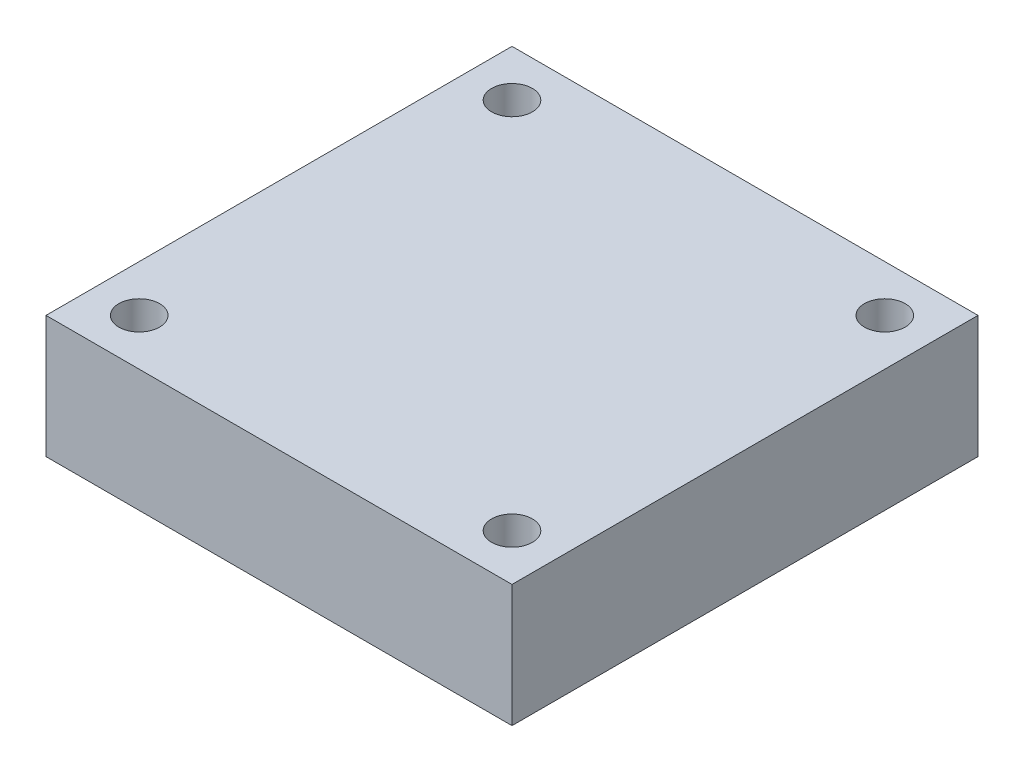
ISO-10303-21;
HEADER;
FILE_DESCRIPTION(('STEP AP214'),'2;1');
FILE_NAME('part.step','',(''),(''),'','','');
FILE_SCHEMA(('AUTOMOTIVE_DESIGN { 1 0 10303 214 1 1 1 1 }'));
ENDSEC;
DATA;
#1=APPLICATION_CONTEXT('core data for automotive mechanical design processes');
#2=APPLICATION_PROTOCOL_DEFINITION('international standard','automotive_design',2000,#1);
#3=PRODUCT_CONTEXT('',#1,'mechanical');
#4=PRODUCT('Part','Part','',(#3));
#5=PRODUCT_RELATED_PRODUCT_CATEGORY('part','',(#4));
#6=PRODUCT_DEFINITION_FORMATION('','',#4);
#7=PRODUCT_DEFINITION_CONTEXT('part definition',#1,'design');
#8=PRODUCT_DEFINITION('design','',#6,#7);
#9=PRODUCT_DEFINITION_SHAPE('','',#8);
#10=(LENGTH_UNIT() NAMED_UNIT(*) SI_UNIT(.MILLI.,.METRE.));
#11=(NAMED_UNIT(*) PLANE_ANGLE_UNIT() SI_UNIT($,.RADIAN.));
#12=(NAMED_UNIT(*) SI_UNIT($,.STERADIAN.) SOLID_ANGLE_UNIT());
#13=UNCERTAINTY_MEASURE_WITH_UNIT(LENGTH_MEASURE(1.E-05),#10,'distance_accuracy_value','');
#14=(GEOMETRIC_REPRESENTATION_CONTEXT(3) GLOBAL_UNCERTAINTY_ASSIGNED_CONTEXT((#13)) GLOBAL_UNIT_ASSIGNED_CONTEXT((#10,
#11,#12)) REPRESENTATION_CONTEXT('',''));
#15=CARTESIAN_POINT('',(0.,0.,0.));
#16=DIRECTION('',(0.,0.,1.));
#17=DIRECTION('',(1.,0.,0.));
#18=AXIS2_PLACEMENT_3D('',#15,#16,#17);
#19=CARTESIAN_POINT('',(-20.,10.5,20.));
#20=DIRECTION('',(1.,0.,0.));
#21=DIRECTION('',(0.,0.,-1.));
#22=AXIS2_PLACEMENT_3D('',#19,#20,#21);
#23=PLANE('',#22);
#24=DIRECTION('',(0.,0.,1.));
#25=VECTOR('',#24,1.);
#26=CARTESIAN_POINT('',(-20.,0.,20.));
#27=LINE('',#26,#25);
#28=CARTESIAN_POINT('',(-20.,0.,-20.));
#29=VERTEX_POINT('',#28);
#30=CARTESIAN_POINT('',(-20.,0.,20.));
#31=VERTEX_POINT('',#30);
#32=EDGE_CURVE('E96',#29,#31,#27,.T.);
#33=ORIENTED_EDGE('',*,*,#32,.T.);
#34=DIRECTION('',(0.,-1.,0.));
#35=VECTOR('',#34,1.);
#36=CARTESIAN_POINT('',(-20.,10.5,20.));
#37=LINE('',#36,#35);
#38=CARTESIAN_POINT('',(-20.,10.5,20.));
#39=VERTEX_POINT('',#38);
#40=EDGE_CURVE('E11',#39,#31,#37,.T.);
#41=ORIENTED_EDGE('',*,*,#40,.F.);
#42=DIRECTION('',(0.,0.,1.));
#43=VECTOR('',#42,1.);
#44=CARTESIAN_POINT('',(-20.,10.5,20.));
#45=LINE('',#44,#43);
#46=CARTESIAN_POINT('',(-20.,10.5,-20.));
#47=VERTEX_POINT('',#46);
#48=EDGE_CURVE('E84',#47,#39,#45,.T.);
#49=ORIENTED_EDGE('',*,*,#48,.F.);
#50=DIRECTION('',(0.,-1.,0.));
#51=VECTOR('',#50,1.);
#52=CARTESIAN_POINT('',(-20.,10.5,-20.));
#53=LINE('',#52,#51);
#54=EDGE_CURVE('E92',#47,#29,#53,.T.);
#55=ORIENTED_EDGE('',*,*,#54,.T.);
#56=EDGE_LOOP('',(#33,#41,#49,#55));
#57=FACE_BOUND('',#56,.T.);
#58=ADVANCED_FACE('F33',(#57),#23,.F.);
#59=CARTESIAN_POINT('',(20.,10.5,20.));
#60=DIRECTION('',(0.,0.,-1.));
#61=DIRECTION('',(-1.,0.,0.));
#62=AXIS2_PLACEMENT_3D('',#59,#60,#61);
#63=PLANE('',#62);
#64=DIRECTION('',(1.,0.,0.));
#65=VECTOR('',#64,1.);
#66=CARTESIAN_POINT('',(20.,0.,20.));
#67=LINE('',#66,#65);
#68=CARTESIAN_POINT('',(20.,0.,20.));
#69=VERTEX_POINT('',#68);
#70=EDGE_CURVE('E88',#31,#69,#67,.T.);
#71=ORIENTED_EDGE('',*,*,#70,.T.);
#72=DIRECTION('',(0.,-1.,0.));
#73=VECTOR('',#72,1.);
#74=CARTESIAN_POINT('',(20.,10.5,20.));
#75=LINE('',#74,#73);
#76=CARTESIAN_POINT('',(20.,10.5,20.));
#77=VERTEX_POINT('',#76);
#78=EDGE_CURVE('E41',#77,#69,#75,.T.);
#79=ORIENTED_EDGE('',*,*,#78,.F.);
#80=DIRECTION('',(1.,0.,0.));
#81=VECTOR('',#80,1.);
#82=CARTESIAN_POINT('',(20.,10.5,20.));
#83=LINE('',#82,#81);
#84=EDGE_CURVE('E79',#39,#77,#83,.T.);
#85=ORIENTED_EDGE('',*,*,#84,.F.);
#86=ORIENTED_EDGE('',*,*,#40,.T.);
#87=EDGE_LOOP('',(#71,#79,#85,#86));
#88=FACE_BOUND('',#87,.T.);
#89=ADVANCED_FACE('F87',(#88),#63,.F.);
#90=CARTESIAN_POINT('',(20.,10.5,20.));
#91=DIRECTION('',(-1.,0.,0.));
#92=DIRECTION('',(0.,0.,1.));
#93=AXIS2_PLACEMENT_3D('',#90,#91,#92);
#94=PLANE('',#93);
#95=DIRECTION('',(0.,0.,-1.));
#96=VECTOR('',#95,1.);
#97=CARTESIAN_POINT('',(20.,0.,20.));
#98=LINE('',#97,#96);
#99=CARTESIAN_POINT('',(20.,0.,-20.));
#100=VERTEX_POINT('',#99);
#101=EDGE_CURVE('E66',#69,#100,#98,.T.);
#102=ORIENTED_EDGE('',*,*,#101,.T.);
#103=DIRECTION('',(0.,-1.,0.));
#104=VECTOR('',#103,1.);
#105=CARTESIAN_POINT('',(20.,10.5,-20.));
#106=LINE('',#105,#104);
#107=CARTESIAN_POINT('',(20.,10.5,-20.));
#108=VERTEX_POINT('',#107);
#109=EDGE_CURVE('E89',#108,#100,#106,.T.);
#110=ORIENTED_EDGE('',*,*,#109,.F.);
#111=DIRECTION('',(0.,0.,-1.));
#112=VECTOR('',#111,1.);
#113=CARTESIAN_POINT('',(20.,10.5,20.));
#114=LINE('',#113,#112);
#115=EDGE_CURVE('E82',#77,#108,#114,.T.);
#116=ORIENTED_EDGE('',*,*,#115,.F.);
#117=ORIENTED_EDGE('',*,*,#78,.T.);
#118=EDGE_LOOP('',(#102,#110,#116,#117));
#119=FACE_BOUND('',#118,.T.);
#120=ADVANCED_FACE('F90',(#119),#94,.F.);
#121=CARTESIAN_POINT('',(20.,10.5,-20.));
#122=DIRECTION('',(0.,0.,1.));
#123=DIRECTION('',(1.,0.,0.));
#124=AXIS2_PLACEMENT_3D('',#121,#122,#123);
#125=PLANE('',#124);
#126=DIRECTION('',(-1.,0.,0.));
#127=VECTOR('',#126,1.);
#128=CARTESIAN_POINT('',(20.,0.,-20.));
#129=LINE('',#128,#127);
#130=EDGE_CURVE('E72',#100,#29,#129,.T.);
#131=ORIENTED_EDGE('',*,*,#130,.T.);
#132=ORIENTED_EDGE('',*,*,#54,.F.);
#133=DIRECTION('',(-1.,0.,0.));
#134=VECTOR('',#133,1.);
#135=CARTESIAN_POINT('',(20.,10.5,-20.));
#136=LINE('',#135,#134);
#137=EDGE_CURVE('E49',#108,#47,#136,.T.);
#138=ORIENTED_EDGE('',*,*,#137,.F.);
#139=ORIENTED_EDGE('',*,*,#109,.T.);
#140=EDGE_LOOP('',(#131,#132,#138,#139));
#141=FACE_BOUND('',#140,.T.);
#142=ADVANCED_FACE('F104',(#141),#125,.F.);
#143=CARTESIAN_POINT('',(0.,10.5,0.));
#144=DIRECTION('',(0.,1.,0.));
#145=DIRECTION('',(0.,0.,1.));
#146=AXIS2_PLACEMENT_3D('',#143,#144,#145);
#147=PLANE('',#146);
#148=CARTESIAN_POINT('',(-16.,10.5,16.));
#149=DIRECTION('',(0.,1.,0.));
#150=DIRECTION('',(0.,0.,1.));
#151=AXIS2_PLACEMENT_3D('',#148,#149,#150);
#152=CIRCLE('',#151,1.75);
#153=CARTESIAN_POINT('',(-16.,10.5,17.75));
#154=VERTEX_POINT('',#153);
#155=EDGE_CURVE('E128',#154,#154,#152,.T.);
#156=ORIENTED_EDGE('',*,*,#155,.F.);
#157=EDGE_LOOP('',(#156));
#158=FACE_BOUND('',#157,.T.);
#159=CARTESIAN_POINT('',(16.,10.5,16.));
#160=DIRECTION('',(0.,1.,0.));
#161=DIRECTION('',(0.,0.,1.));
#162=AXIS2_PLACEMENT_3D('',#159,#160,#161);
#163=CIRCLE('',#162,1.75);
#164=CARTESIAN_POINT('',(16.,10.5,17.75));
#165=VERTEX_POINT('',#164);
#166=EDGE_CURVE('E122',#165,#165,#163,.T.);
#167=ORIENTED_EDGE('',*,*,#166,.F.);
#168=EDGE_LOOP('',(#167));
#169=FACE_BOUND('',#168,.T.);
#170=CARTESIAN_POINT('',(16.,10.5,-16.));
#171=DIRECTION('',(0.,1.,0.));
#172=DIRECTION('',(0.,0.,1.));
#173=AXIS2_PLACEMENT_3D('',#170,#171,#172);
#174=CIRCLE('',#173,1.75);
#175=CARTESIAN_POINT('',(16.,10.5,-14.25));
#176=VERTEX_POINT('',#175);
#177=EDGE_CURVE('E116',#176,#176,#174,.T.);
#178=ORIENTED_EDGE('',*,*,#177,.F.);
#179=EDGE_LOOP('',(#178));
#180=FACE_BOUND('',#179,.T.);
#181=CARTESIAN_POINT('',(-16.,10.5,-16.));
#182=DIRECTION('',(0.,1.,0.));
#183=DIRECTION('',(0.,0.,1.));
#184=AXIS2_PLACEMENT_3D('',#181,#182,#183);
#185=CIRCLE('',#184,1.75);
#186=CARTESIAN_POINT('',(-16.,10.5,-14.25));
#187=VERTEX_POINT('',#186);
#188=EDGE_CURVE('E110',#187,#187,#185,.T.);
#189=ORIENTED_EDGE('',*,*,#188,.F.);
#190=EDGE_LOOP('',(#189));
#191=FACE_BOUND('',#190,.T.);
#192=ORIENTED_EDGE('',*,*,#48,.T.);
#193=ORIENTED_EDGE('',*,*,#84,.T.);
#194=ORIENTED_EDGE('',*,*,#115,.T.);
#195=ORIENTED_EDGE('',*,*,#137,.T.);
#196=EDGE_LOOP('',(#192,#193,#194,#195));
#197=FACE_BOUND('',#196,.T.);
#198=ADVANCED_FACE('F80',(#158,#169,#180,#191,#197),#147,.T.);
#199=CARTESIAN_POINT('',(0.,0.,0.));
#200=DIRECTION('',(0.,1.,0.));
#201=DIRECTION('',(0.,0.,1.));
#202=AXIS2_PLACEMENT_3D('',#199,#200,#201);
#203=PLANE('',#202);
#204=CARTESIAN_POINT('',(-16.,0.,16.));
#205=DIRECTION('',(0.,1.,0.));
#206=DIRECTION('',(0.,0.,1.));
#207=AXIS2_PLACEMENT_3D('',#204,#205,#206);
#208=CIRCLE('',#207,1.75);
#209=CARTESIAN_POINT('',(-16.,0.,17.75));
#210=VERTEX_POINT('',#209);
#211=EDGE_CURVE('E125',#210,#210,#208,.T.);
#212=ORIENTED_EDGE('',*,*,#211,.T.);
#213=EDGE_LOOP('',(#212));
#214=FACE_BOUND('',#213,.T.);
#215=CARTESIAN_POINT('',(16.,0.,16.));
#216=DIRECTION('',(0.,1.,0.));
#217=DIRECTION('',(0.,0.,1.));
#218=AXIS2_PLACEMENT_3D('',#215,#216,#217);
#219=CIRCLE('',#218,1.75);
#220=CARTESIAN_POINT('',(16.,0.,17.75));
#221=VERTEX_POINT('',#220);
#222=EDGE_CURVE('E119',#221,#221,#219,.T.);
#223=ORIENTED_EDGE('',*,*,#222,.T.);
#224=EDGE_LOOP('',(#223));
#225=FACE_BOUND('',#224,.T.);
#226=CARTESIAN_POINT('',(16.,0.,-16.));
#227=DIRECTION('',(0.,1.,0.));
#228=DIRECTION('',(0.,0.,1.));
#229=AXIS2_PLACEMENT_3D('',#226,#227,#228);
#230=CIRCLE('',#229,1.75);
#231=CARTESIAN_POINT('',(16.,0.,-14.25));
#232=VERTEX_POINT('',#231);
#233=EDGE_CURVE('E113',#232,#232,#230,.T.);
#234=ORIENTED_EDGE('',*,*,#233,.T.);
#235=EDGE_LOOP('',(#234));
#236=FACE_BOUND('',#235,.T.);
#237=CARTESIAN_POINT('',(-16.,0.,-16.));
#238=DIRECTION('',(0.,1.,0.));
#239=DIRECTION('',(0.,0.,1.));
#240=AXIS2_PLACEMENT_3D('',#237,#238,#239);
#241=CIRCLE('',#240,1.75);
#242=CARTESIAN_POINT('',(-16.,0.,-14.25));
#243=VERTEX_POINT('',#242);
#244=EDGE_CURVE('E99',#243,#243,#241,.T.);
#245=ORIENTED_EDGE('',*,*,#244,.T.);
#246=EDGE_LOOP('',(#245));
#247=FACE_BOUND('',#246,.T.);
#248=ORIENTED_EDGE('',*,*,#32,.F.);
#249=ORIENTED_EDGE('',*,*,#130,.F.);
#250=ORIENTED_EDGE('',*,*,#101,.F.);
#251=ORIENTED_EDGE('',*,*,#70,.F.);
#252=EDGE_LOOP('',(#248,#249,#250,#251));
#253=FACE_BOUND('',#252,.T.);
#254=ADVANCED_FACE('F107',(#214,#225,#236,#247,#253),#203,.F.);
#255=CARTESIAN_POINT('',(-16.,0.,-16.));
#256=DIRECTION('',(0.,1.,0.));
#257=DIRECTION('',(0.,0.,1.));
#258=AXIS2_PLACEMENT_3D('',#255,#256,#257);
#259=CYLINDRICAL_SURFACE('',#258,1.75);
#260=ORIENTED_EDGE('',*,*,#244,.F.);
#261=EDGE_LOOP('',(#260));
#262=FACE_BOUND('',#261,.T.);
#263=ORIENTED_EDGE('',*,*,#188,.T.);
#264=EDGE_LOOP('',(#263));
#265=FACE_BOUND('',#264,.T.);
#266=ADVANCED_FACE('F152',(#262,#265),#259,.F.);
#267=CARTESIAN_POINT('',(16.,0.,-16.));
#268=DIRECTION('',(0.,1.,0.));
#269=DIRECTION('',(0.,0.,1.));
#270=AXIS2_PLACEMENT_3D('',#267,#268,#269);
#271=CYLINDRICAL_SURFACE('',#270,1.75);
#272=ORIENTED_EDGE('',*,*,#233,.F.);
#273=EDGE_LOOP('',(#272));
#274=FACE_BOUND('',#273,.T.);
#275=ORIENTED_EDGE('',*,*,#177,.T.);
#276=EDGE_LOOP('',(#275));
#277=FACE_BOUND('',#276,.T.);
#278=ADVANCED_FACE('F154',(#274,#277),#271,.F.);
#279=CARTESIAN_POINT('',(16.,0.,16.));
#280=DIRECTION('',(0.,1.,0.));
#281=DIRECTION('',(0.,0.,1.));
#282=AXIS2_PLACEMENT_3D('',#279,#280,#281);
#283=CYLINDRICAL_SURFACE('',#282,1.75);
#284=ORIENTED_EDGE('',*,*,#222,.F.);
#285=EDGE_LOOP('',(#284));
#286=FACE_BOUND('',#285,.T.);
#287=ORIENTED_EDGE('',*,*,#166,.T.);
#288=EDGE_LOOP('',(#287));
#289=FACE_BOUND('',#288,.T.);
#290=ADVANCED_FACE('F139',(#286,#289),#283,.F.);
#291=CARTESIAN_POINT('',(-16.,0.,16.));
#292=DIRECTION('',(0.,1.,0.));
#293=DIRECTION('',(0.,0.,1.));
#294=AXIS2_PLACEMENT_3D('',#291,#292,#293);
#295=CYLINDRICAL_SURFACE('',#294,1.75);
#296=ORIENTED_EDGE('',*,*,#211,.F.);
#297=EDGE_LOOP('',(#296));
#298=FACE_BOUND('',#297,.T.);
#299=ORIENTED_EDGE('',*,*,#155,.T.);
#300=EDGE_LOOP('',(#299));
#301=FACE_BOUND('',#300,.T.);
#302=ADVANCED_FACE('F136',(#298,#301),#295,.F.);
#303=CLOSED_SHELL('',(#58,#89,#120,#142,#198,#254,#266,#278,#290,#302));
#304=MANIFOLD_SOLID_BREP('B2',#303);
#305=ADVANCED_BREP_SHAPE_REPRESENTATION('',(#18,#304),#14);
#306=SHAPE_DEFINITION_REPRESENTATION(#9,#305);
ENDSEC;
END-ISO-10303-21;
